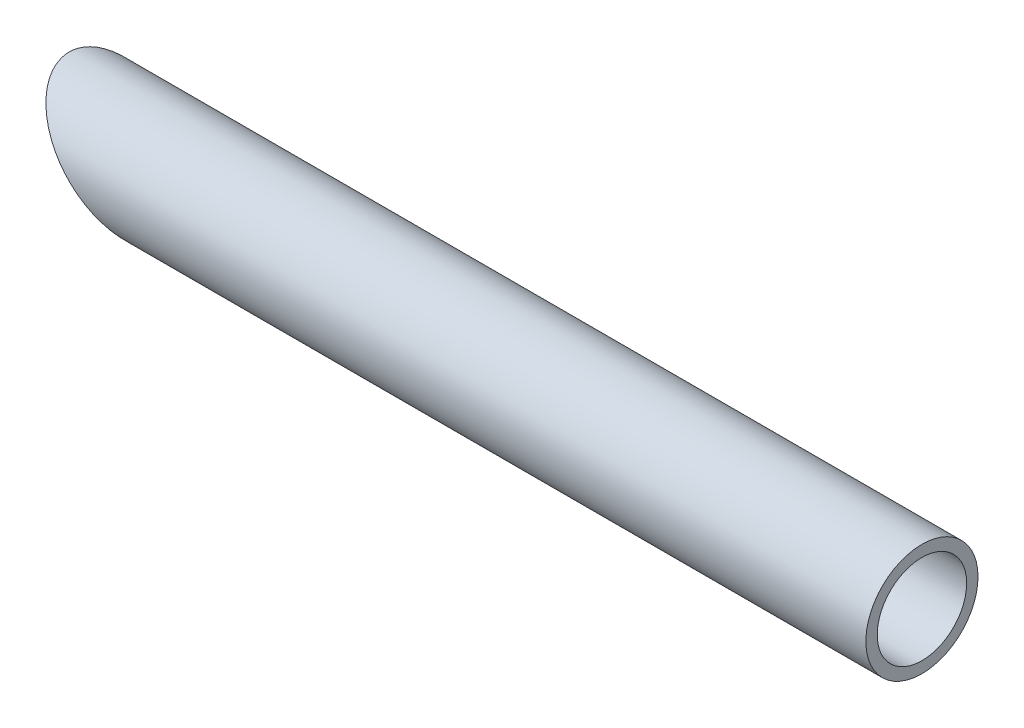
ISO-10303-21;
HEADER;
FILE_DESCRIPTION(('STEP AP214'),'2;1');
FILE_NAME('part.step','',(''),(''),'','','');
FILE_SCHEMA(('AUTOMOTIVE_DESIGN { 1 0 10303 214 1 1 1 1 }'));
ENDSEC;
DATA;
#1=APPLICATION_CONTEXT('core data for automotive mechanical design processes');
#2=APPLICATION_PROTOCOL_DEFINITION('international standard','automotive_design',2000,#1);
#3=PRODUCT_CONTEXT('',#1,'mechanical');
#4=PRODUCT('Part','Part','',(#3));
#5=PRODUCT_RELATED_PRODUCT_CATEGORY('part','',(#4));
#6=PRODUCT_DEFINITION_FORMATION('','',#4);
#7=PRODUCT_DEFINITION_CONTEXT('part definition',#1,'design');
#8=PRODUCT_DEFINITION('design','',#6,#7);
#9=PRODUCT_DEFINITION_SHAPE('','',#8);
#10=(LENGTH_UNIT() NAMED_UNIT(*) SI_UNIT(.MILLI.,.METRE.));
#11=(NAMED_UNIT(*) PLANE_ANGLE_UNIT() SI_UNIT($,.RADIAN.));
#12=(NAMED_UNIT(*) SI_UNIT($,.STERADIAN.) SOLID_ANGLE_UNIT());
#13=UNCERTAINTY_MEASURE_WITH_UNIT(LENGTH_MEASURE(1.E-05),#10,'distance_accuracy_value','');
#14=(GEOMETRIC_REPRESENTATION_CONTEXT(3) GLOBAL_UNCERTAINTY_ASSIGNED_CONTEXT((#13)) GLOBAL_UNIT_ASSIGNED_CONTEXT((#10,
#11,#12)) REPRESENTATION_CONTEXT('',''));
#15=CARTESIAN_POINT('',(0.,0.,0.));
#16=DIRECTION('',(0.,0.,1.));
#17=DIRECTION('',(1.,0.,0.));
#18=AXIS2_PLACEMENT_3D('',#15,#16,#17);
#19=CARTESIAN_POINT('',(0.,0.,0.));
#20=DIRECTION('',(1.,0.,0.));
#21=DIRECTION('',(0.,0.,-1.));
#22=AXIS2_PLACEMENT_3D('',#19,#20,#21);
#23=CYLINDRICAL_SURFACE('',#22,13.3223);
#24=CARTESIAN_POINT('',(254.,0.,0.));
#25=DIRECTION('',(1.,0.,0.));
#26=DIRECTION('',(0.,0.,-1.));
#27=AXIS2_PLACEMENT_3D('',#24,#25,#26);
#28=CIRCLE('',#27,13.3223);
#29=CARTESIAN_POINT('',(254.,0.,-13.3223));
#30=VERTEX_POINT('',#29);
#31=EDGE_CURVE('E17',#30,#30,#28,.F.);
#32=ORIENTED_EDGE('',*,*,#31,.F.);
#33=EDGE_LOOP('',(#32));
#34=FACE_BOUND('',#33,.T.);
#35=CARTESIAN_POINT('',(16.7005,0.,0.));
#36=DIRECTION('',(0.707106781186548,0.707106781186548,0.));
#37=DIRECTION('',(0.707106781186548,-0.707106781186548,0.));
#38=AXIS2_PLACEMENT_3D('',#35,#36,#37);
#39=ELLIPSE('',#38,18.8405773420031,13.3223);
#40=CARTESIAN_POINT('',(30.0228,-13.3223,0.));
#41=VERTEX_POINT('',#40);
#42=EDGE_CURVE('E26',#41,#41,#39,.F.);
#43=ORIENTED_EDGE('',*,*,#42,.T.);
#44=EDGE_LOOP('',(#43));
#45=FACE_BOUND('',#44,.T.);
#46=ADVANCED_FACE('F14',(#34,#45),#23,.F.);
#47=CARTESIAN_POINT('',(254.,0.,0.));
#48=DIRECTION('',(1.,0.,0.));
#49=DIRECTION('',(0.,0.,-1.));
#50=AXIS2_PLACEMENT_3D('',#47,#48,#49);
#51=PLANE('',#50);
#52=ORIENTED_EDGE('',*,*,#31,.T.);
#53=EDGE_LOOP('',(#52));
#54=FACE_BOUND('',#53,.T.);
#55=CARTESIAN_POINT('',(254.,0.,0.));
#56=DIRECTION('',(1.,0.,0.));
#57=DIRECTION('',(0.,0.,-1.));
#58=AXIS2_PLACEMENT_3D('',#55,#56,#57);
#59=CIRCLE('',#58,16.7005);
#60=CARTESIAN_POINT('',(254.,0.,-16.7005));
#61=VERTEX_POINT('',#60);
#62=EDGE_CURVE('E21',#61,#61,#59,.F.);
#63=ORIENTED_EDGE('',*,*,#62,.F.);
#64=EDGE_LOOP('',(#63));
#65=FACE_BOUND('',#64,.T.);
#66=ADVANCED_FACE('F34',(#54,#65),#51,.T.);
#67=CARTESIAN_POINT('',(33.401,-16.7005,-32.2961));
#68=DIRECTION('',(0.707106781186548,0.707106781186548,0.));
#69=DIRECTION('',(-0.707106781186548,0.707106781186548,0.));
#70=AXIS2_PLACEMENT_3D('',#67,#68,#69);
#71=PLANE('',#70);
#72=ORIENTED_EDGE('',*,*,#42,.F.);
#73=EDGE_LOOP('',(#72));
#74=FACE_BOUND('',#73,.T.);
#75=CARTESIAN_POINT('',(16.7005,0.,0.));
#76=DIRECTION('',(0.707106781186548,0.707106781186548,0.));
#77=DIRECTION('',(0.707106781186548,-0.707106781186548,0.));
#78=AXIS2_PLACEMENT_3D('',#75,#76,#77);
#79=ELLIPSE('',#78,23.6180735984119,16.7005);
#80=CARTESIAN_POINT('',(33.401,-16.7005,0.));
#81=VERTEX_POINT('',#80);
#82=EDGE_CURVE('E10',#81,#81,#79,.T.);
#83=ORIENTED_EDGE('',*,*,#82,.F.);
#84=EDGE_LOOP('',(#83));
#85=FACE_BOUND('',#84,.T.);
#86=ADVANCED_FACE('F42',(#74,#85),#71,.F.);
#87=CARTESIAN_POINT('',(0.,0.,0.));
#88=DIRECTION('',(1.,0.,0.));
#89=DIRECTION('',(0.,0.,-1.));
#90=AXIS2_PLACEMENT_3D('',#87,#88,#89);
#91=CYLINDRICAL_SURFACE('',#90,16.7005);
#92=ORIENTED_EDGE('',*,*,#62,.T.);
#93=EDGE_LOOP('',(#92));
#94=FACE_BOUND('',#93,.T.);
#95=ORIENTED_EDGE('',*,*,#82,.T.);
#96=EDGE_LOOP('',(#95));
#97=FACE_BOUND('',#96,.T.);
#98=ADVANCED_FACE('F43',(#94,#97),#91,.T.);
#99=CLOSED_SHELL('',(#46,#66,#86,#98));
#100=MANIFOLD_SOLID_BREP('B1',#99);
#101=ADVANCED_BREP_SHAPE_REPRESENTATION('',(#18,#100),#14);
#102=SHAPE_DEFINITION_REPRESENTATION(#9,#101);
ENDSEC;
END-ISO-10303-21;
